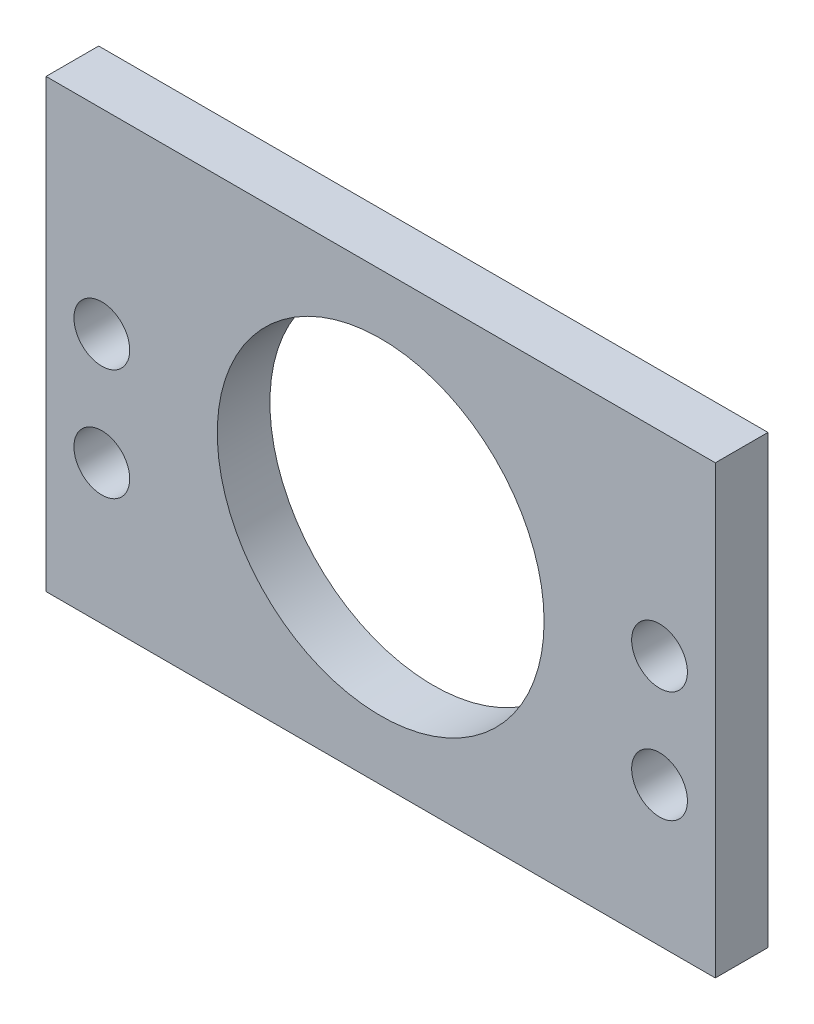
ISO-10303-21;
HEADER;
FILE_DESCRIPTION(('STEP AP214'),'2;1');
FILE_NAME('part.step','',(''),(''),'','','');
FILE_SCHEMA(('AUTOMOTIVE_DESIGN { 1 0 10303 214 1 1 1 1 }'));
ENDSEC;
DATA;
#1=APPLICATION_CONTEXT('core data for automotive mechanical design processes');
#2=APPLICATION_PROTOCOL_DEFINITION('international standard','automotive_design',2000,#1);
#3=PRODUCT_CONTEXT('',#1,'mechanical');
#4=PRODUCT('Part','Part','',(#3));
#5=PRODUCT_RELATED_PRODUCT_CATEGORY('part','',(#4));
#6=PRODUCT_DEFINITION_FORMATION('','',#4);
#7=PRODUCT_DEFINITION_CONTEXT('part definition',#1,'design');
#8=PRODUCT_DEFINITION('design','',#6,#7);
#9=PRODUCT_DEFINITION_SHAPE('','',#8);
#10=(LENGTH_UNIT() NAMED_UNIT(*) SI_UNIT(.MILLI.,.METRE.));
#11=(NAMED_UNIT(*) PLANE_ANGLE_UNIT() SI_UNIT($,.RADIAN.));
#12=(NAMED_UNIT(*) SI_UNIT($,.STERADIAN.) SOLID_ANGLE_UNIT());
#13=UNCERTAINTY_MEASURE_WITH_UNIT(LENGTH_MEASURE(1.E-05),#10,'distance_accuracy_value','');
#14=(GEOMETRIC_REPRESENTATION_CONTEXT(3) GLOBAL_UNCERTAINTY_ASSIGNED_CONTEXT((#13)) GLOBAL_UNIT_ASSIGNED_CONTEXT((#10,
#11,#12)) REPRESENTATION_CONTEXT('',''));
#15=CARTESIAN_POINT('',(0.,0.,0.));
#16=DIRECTION('',(0.,0.,1.));
#17=DIRECTION('',(1.,0.,0.));
#18=AXIS2_PLACEMENT_3D('',#15,#16,#17);
#19=CARTESIAN_POINT('',(0.,0.,5.9944));
#20=DIRECTION('',(0.,0.,-1.));
#21=DIRECTION('',(-1.,0.,0.));
#22=AXIS2_PLACEMENT_3D('',#19,#20,#21);
#23=PLANE('',#22);
#24=CARTESIAN_POINT('',(69.85,28.575,5.9944));
#25=DIRECTION('',(0.,0.,1.));
#26=DIRECTION('',(1.,0.,0.));
#27=AXIS2_PLACEMENT_3D('',#24,#25,#26);
#28=CIRCLE('',#27,3.175);
#29=CARTESIAN_POINT('',(73.025,28.575,5.9944));
#30=VERTEX_POINT('',#29);
#31=EDGE_CURVE('E126',#30,#30,#28,.T.);
#32=ORIENTED_EDGE('',*,*,#31,.F.);
#33=EDGE_LOOP('',(#32));
#34=FACE_BOUND('',#33,.T.);
#35=CARTESIAN_POINT('',(6.35,28.575,5.9944));
#36=DIRECTION('',(0.,0.,1.));
#37=DIRECTION('',(1.,0.,0.));
#38=AXIS2_PLACEMENT_3D('',#35,#36,#37);
#39=CIRCLE('',#38,3.175);
#40=CARTESIAN_POINT('',(9.525,28.575,5.9944));
#41=VERTEX_POINT('',#40);
#42=EDGE_CURVE('E114',#41,#41,#39,.T.);
#43=ORIENTED_EDGE('',*,*,#42,.F.);
#44=EDGE_LOOP('',(#43));
#45=FACE_BOUND('',#44,.T.);
#46=DIRECTION('',(0.,-1.,0.));
#47=VECTOR('',#46,1.);
#48=CARTESIAN_POINT('',(0.,0.,5.9944));
#49=LINE('',#48,#47);
#50=CARTESIAN_POINT('',(0.,50.8,5.9944));
#51=VERTEX_POINT('',#50);
#52=CARTESIAN_POINT('',(0.,0.,5.9944));
#53=VERTEX_POINT('',#52);
#54=EDGE_CURVE('E84',#51,#53,#49,.T.);
#55=ORIENTED_EDGE('',*,*,#54,.T.);
#56=DIRECTION('',(1.,0.,0.));
#57=VECTOR('',#56,1.);
#58=CARTESIAN_POINT('',(0.,0.,5.9944));
#59=LINE('',#58,#57);
#60=CARTESIAN_POINT('',(76.2,0.,5.9944));
#61=VERTEX_POINT('',#60);
#62=EDGE_CURVE('E79',#53,#61,#59,.T.);
#63=ORIENTED_EDGE('',*,*,#62,.T.);
#64=DIRECTION('',(0.,1.,0.));
#65=VECTOR('',#64,1.);
#66=CARTESIAN_POINT('',(76.2,0.,5.9944));
#67=LINE('',#66,#65);
#68=CARTESIAN_POINT('',(76.2,50.8,5.9944));
#69=VERTEX_POINT('',#68);
#70=EDGE_CURVE('E82',#61,#69,#67,.T.);
#71=ORIENTED_EDGE('',*,*,#70,.T.);
#72=DIRECTION('',(-1.,0.,0.));
#73=VECTOR('',#72,1.);
#74=CARTESIAN_POINT('',(0.,50.8,5.9944));
#75=LINE('',#74,#73);
#76=EDGE_CURVE('E49',#69,#51,#75,.T.);
#77=ORIENTED_EDGE('',*,*,#76,.T.);
#78=EDGE_LOOP('',(#55,#63,#71,#77));
#79=FACE_BOUND('',#78,.T.);
#80=CARTESIAN_POINT('',(38.1,25.4,5.9944));
#81=DIRECTION('',(0.,0.,1.));
#82=DIRECTION('',(1.,0.,0.));
#83=AXIS2_PLACEMENT_3D('',#80,#81,#82);
#84=CIRCLE('',#83,18.6055);
#85=CARTESIAN_POINT('',(56.7055,25.4,5.9944));
#86=VERTEX_POINT('',#85);
#87=EDGE_CURVE('E99',#86,#86,#84,.T.);
#88=ORIENTED_EDGE('',*,*,#87,.F.);
#89=EDGE_LOOP('',(#88));
#90=FACE_BOUND('',#89,.T.);
#91=CARTESIAN_POINT('',(6.35,15.875,5.9944));
#92=DIRECTION('',(0.,0.,1.));
#93=DIRECTION('',(1.,0.,0.));
#94=AXIS2_PLACEMENT_3D('',#91,#92,#93);
#95=CIRCLE('',#94,3.175);
#96=CARTESIAN_POINT('',(9.525,15.875,5.9944));
#97=VERTEX_POINT('',#96);
#98=EDGE_CURVE('E120',#97,#97,#95,.T.);
#99=ORIENTED_EDGE('',*,*,#98,.F.);
#100=EDGE_LOOP('',(#99));
#101=FACE_BOUND('',#100,.T.);
#102=CARTESIAN_POINT('',(69.85,15.875,5.9944));
#103=DIRECTION('',(0.,0.,1.));
#104=DIRECTION('',(1.,0.,0.));
#105=AXIS2_PLACEMENT_3D('',#102,#103,#104);
#106=CIRCLE('',#105,3.175);
#107=CARTESIAN_POINT('',(73.025,15.875,5.9944));
#108=VERTEX_POINT('',#107);
#109=EDGE_CURVE('E132',#108,#108,#106,.T.);
#110=ORIENTED_EDGE('',*,*,#109,.F.);
#111=EDGE_LOOP('',(#110));
#112=FACE_BOUND('',#111,.T.);
#113=ADVANCED_FACE('F32',(#34,#45,#79,#90,#101,#112),#23,.F.);
#114=CARTESIAN_POINT('',(0.,0.,0.));
#115=DIRECTION('',(0.,0.,-1.));
#116=DIRECTION('',(-1.,0.,0.));
#117=AXIS2_PLACEMENT_3D('',#114,#115,#116);
#118=PLANE('',#117);
#119=CARTESIAN_POINT('',(69.85,28.575,0.));
#120=DIRECTION('',(0.,0.,1.));
#121=DIRECTION('',(1.,0.,0.));
#122=AXIS2_PLACEMENT_3D('',#119,#120,#121);
#123=CIRCLE('',#122,3.175);
#124=CARTESIAN_POINT('',(73.025,28.575,0.));
#125=VERTEX_POINT('',#124);
#126=EDGE_CURVE('E129',#125,#125,#123,.T.);
#127=ORIENTED_EDGE('',*,*,#126,.T.);
#128=EDGE_LOOP('',(#127));
#129=FACE_BOUND('',#128,.T.);
#130=CARTESIAN_POINT('',(6.35,28.575,0.));
#131=DIRECTION('',(0.,0.,1.));
#132=DIRECTION('',(1.,0.,0.));
#133=AXIS2_PLACEMENT_3D('',#130,#131,#132);
#134=CIRCLE('',#133,3.175);
#135=CARTESIAN_POINT('',(9.525,28.575,0.));
#136=VERTEX_POINT('',#135);
#137=EDGE_CURVE('E117',#136,#136,#134,.T.);
#138=ORIENTED_EDGE('',*,*,#137,.T.);
#139=EDGE_LOOP('',(#138));
#140=FACE_BOUND('',#139,.T.);
#141=DIRECTION('',(0.,-1.,0.));
#142=VECTOR('',#141,1.);
#143=CARTESIAN_POINT('',(0.,0.,0.));
#144=LINE('',#143,#142);
#145=CARTESIAN_POINT('',(0.,50.8,0.));
#146=VERTEX_POINT('',#145);
#147=CARTESIAN_POINT('',(0.,0.,0.));
#148=VERTEX_POINT('',#147);
#149=EDGE_CURVE('E96',#146,#148,#144,.T.);
#150=ORIENTED_EDGE('',*,*,#149,.F.);
#151=DIRECTION('',(-1.,0.,0.));
#152=VECTOR('',#151,1.);
#153=CARTESIAN_POINT('',(0.,50.8,0.));
#154=LINE('',#153,#152);
#155=CARTESIAN_POINT('',(76.2,50.8,0.));
#156=VERTEX_POINT('',#155);
#157=EDGE_CURVE('E72',#156,#146,#154,.T.);
#158=ORIENTED_EDGE('',*,*,#157,.F.);
#159=DIRECTION('',(0.,1.,0.));
#160=VECTOR('',#159,1.);
#161=CARTESIAN_POINT('',(76.2,0.,0.));
#162=LINE('',#161,#160);
#163=CARTESIAN_POINT('',(76.2,0.,0.));
#164=VERTEX_POINT('',#163);
#165=EDGE_CURVE('E66',#164,#156,#162,.T.);
#166=ORIENTED_EDGE('',*,*,#165,.F.);
#167=DIRECTION('',(1.,0.,0.));
#168=VECTOR('',#167,1.);
#169=CARTESIAN_POINT('',(0.,0.,0.));
#170=LINE('',#169,#168);
#171=EDGE_CURVE('E88',#148,#164,#170,.T.);
#172=ORIENTED_EDGE('',*,*,#171,.F.);
#173=EDGE_LOOP('',(#150,#158,#166,#172));
#174=FACE_BOUND('',#173,.T.);
#175=CARTESIAN_POINT('',(38.1,25.4,0.));
#176=DIRECTION('',(0.,0.,1.));
#177=DIRECTION('',(1.,0.,0.));
#178=AXIS2_PLACEMENT_3D('',#175,#176,#177);
#179=CIRCLE('',#178,18.6055);
#180=CARTESIAN_POINT('',(56.7055,25.4,0.));
#181=VERTEX_POINT('',#180);
#182=EDGE_CURVE('E111',#181,#181,#179,.T.);
#183=ORIENTED_EDGE('',*,*,#182,.T.);
#184=EDGE_LOOP('',(#183));
#185=FACE_BOUND('',#184,.T.);
#186=CARTESIAN_POINT('',(6.35,15.875,0.));
#187=DIRECTION('',(0.,0.,1.));
#188=DIRECTION('',(1.,0.,0.));
#189=AXIS2_PLACEMENT_3D('',#186,#187,#188);
#190=CIRCLE('',#189,3.175);
#191=CARTESIAN_POINT('',(9.525,15.875,0.));
#192=VERTEX_POINT('',#191);
#193=EDGE_CURVE('E123',#192,#192,#190,.T.);
#194=ORIENTED_EDGE('',*,*,#193,.T.);
#195=EDGE_LOOP('',(#194));
#196=FACE_BOUND('',#195,.T.);
#197=CARTESIAN_POINT('',(69.85,15.875,0.));
#198=DIRECTION('',(0.,0.,1.));
#199=DIRECTION('',(1.,0.,0.));
#200=AXIS2_PLACEMENT_3D('',#197,#198,#199);
#201=CIRCLE('',#200,3.175);
#202=CARTESIAN_POINT('',(73.025,15.875,0.));
#203=VERTEX_POINT('',#202);
#204=EDGE_CURVE('E135',#203,#203,#201,.T.);
#205=ORIENTED_EDGE('',*,*,#204,.T.);
#206=EDGE_LOOP('',(#205));
#207=FACE_BOUND('',#206,.T.);
#208=ADVANCED_FACE('F107',(#129,#140,#174,#185,#196,#207),#118,.T.);
#209=CARTESIAN_POINT('',(0.,0.,5.9944));
#210=DIRECTION('',(1.,0.,0.));
#211=DIRECTION('',(0.,0.,-1.));
#212=AXIS2_PLACEMENT_3D('',#209,#210,#211);
#213=PLANE('',#212);
#214=ORIENTED_EDGE('',*,*,#149,.T.);
#215=DIRECTION('',(0.,0.,-1.));
#216=VECTOR('',#215,1.);
#217=CARTESIAN_POINT('',(0.,0.,5.9944));
#218=LINE('',#217,#216);
#219=EDGE_CURVE('E11',#53,#148,#218,.T.);
#220=ORIENTED_EDGE('',*,*,#219,.F.);
#221=ORIENTED_EDGE('',*,*,#54,.F.);
#222=DIRECTION('',(0.,0.,-1.));
#223=VECTOR('',#222,1.);
#224=CARTESIAN_POINT('',(0.,50.8,5.9944));
#225=LINE('',#224,#223);
#226=EDGE_CURVE('E92',#51,#146,#225,.T.);
#227=ORIENTED_EDGE('',*,*,#226,.T.);
#228=EDGE_LOOP('',(#214,#220,#221,#227));
#229=FACE_BOUND('',#228,.T.);
#230=ADVANCED_FACE('F34',(#229),#213,.F.);
#231=CARTESIAN_POINT('',(0.,0.,5.9944));
#232=DIRECTION('',(0.,1.,0.));
#233=DIRECTION('',(0.,0.,1.));
#234=AXIS2_PLACEMENT_3D('',#231,#232,#233);
#235=PLANE('',#234);
#236=ORIENTED_EDGE('',*,*,#171,.T.);
#237=DIRECTION('',(0.,0.,-1.));
#238=VECTOR('',#237,1.);
#239=CARTESIAN_POINT('',(76.2,0.,5.9944));
#240=LINE('',#239,#238);
#241=EDGE_CURVE('E41',#61,#164,#240,.T.);
#242=ORIENTED_EDGE('',*,*,#241,.F.);
#243=ORIENTED_EDGE('',*,*,#62,.F.);
#244=ORIENTED_EDGE('',*,*,#219,.T.);
#245=EDGE_LOOP('',(#236,#242,#243,#244));
#246=FACE_BOUND('',#245,.T.);
#247=ADVANCED_FACE('F87',(#246),#235,.F.);
#248=CARTESIAN_POINT('',(76.2,0.,5.9944));
#249=DIRECTION('',(-1.,0.,0.));
#250=DIRECTION('',(0.,0.,1.));
#251=AXIS2_PLACEMENT_3D('',#248,#249,#250);
#252=PLANE('',#251);
#253=ORIENTED_EDGE('',*,*,#165,.T.);
#254=DIRECTION('',(0.,0.,-1.));
#255=VECTOR('',#254,1.);
#256=CARTESIAN_POINT('',(76.2,50.8,5.9944));
#257=LINE('',#256,#255);
#258=EDGE_CURVE('E89',#69,#156,#257,.T.);
#259=ORIENTED_EDGE('',*,*,#258,.F.);
#260=ORIENTED_EDGE('',*,*,#70,.F.);
#261=ORIENTED_EDGE('',*,*,#241,.T.);
#262=EDGE_LOOP('',(#253,#259,#260,#261));
#263=FACE_BOUND('',#262,.T.);
#264=ADVANCED_FACE('F90',(#263),#252,.F.);
#265=CARTESIAN_POINT('',(0.,50.8,5.9944));
#266=DIRECTION('',(0.,-1.,0.));
#267=DIRECTION('',(0.,0.,-1.));
#268=AXIS2_PLACEMENT_3D('',#265,#266,#267);
#269=PLANE('',#268);
#270=ORIENTED_EDGE('',*,*,#157,.T.);
#271=ORIENTED_EDGE('',*,*,#226,.F.);
#272=ORIENTED_EDGE('',*,*,#76,.F.);
#273=ORIENTED_EDGE('',*,*,#258,.T.);
#274=EDGE_LOOP('',(#270,#271,#272,#273));
#275=FACE_BOUND('',#274,.T.);
#276=ADVANCED_FACE('F104',(#275),#269,.F.);
#277=CARTESIAN_POINT('',(38.1,25.4,5.9944));
#278=DIRECTION('',(0.,0.,-1.));
#279=DIRECTION('',(-1.,0.,0.));
#280=AXIS2_PLACEMENT_3D('',#277,#278,#279);
#281=CYLINDRICAL_SURFACE('',#280,18.6055);
#282=ORIENTED_EDGE('',*,*,#87,.T.);
#283=EDGE_LOOP('',(#282));
#284=FACE_BOUND('',#283,.T.);
#285=ORIENTED_EDGE('',*,*,#182,.F.);
#286=EDGE_LOOP('',(#285));
#287=FACE_BOUND('',#286,.T.);
#288=ADVANCED_FACE('F155',(#284,#287),#281,.F.);
#289=CARTESIAN_POINT('',(6.35,28.575,5.9944));
#290=DIRECTION('',(0.,0.,-1.));
#291=DIRECTION('',(-1.,0.,0.));
#292=AXIS2_PLACEMENT_3D('',#289,#290,#291);
#293=CYLINDRICAL_SURFACE('',#292,3.175);
#294=ORIENTED_EDGE('',*,*,#42,.T.);
#295=EDGE_LOOP('',(#294));
#296=FACE_BOUND('',#295,.T.);
#297=ORIENTED_EDGE('',*,*,#137,.F.);
#298=EDGE_LOOP('',(#297));
#299=FACE_BOUND('',#298,.T.);
#300=ADVANCED_FACE('F201',(#296,#299),#293,.F.);
#301=CARTESIAN_POINT('',(6.35,15.875,5.9944));
#302=DIRECTION('',(0.,0.,-1.));
#303=DIRECTION('',(-1.,0.,0.));
#304=AXIS2_PLACEMENT_3D('',#301,#302,#303);
#305=CYLINDRICAL_SURFACE('',#304,3.175);
#306=ORIENTED_EDGE('',*,*,#98,.T.);
#307=EDGE_LOOP('',(#306));
#308=FACE_BOUND('',#307,.T.);
#309=ORIENTED_EDGE('',*,*,#193,.F.);
#310=EDGE_LOOP('',(#309));
#311=FACE_BOUND('',#310,.T.);
#312=ADVANCED_FACE('F209',(#308,#311),#305,.F.);
#313=CARTESIAN_POINT('',(69.85,28.575,5.9944));
#314=DIRECTION('',(0.,0.,-1.));
#315=DIRECTION('',(-1.,0.,0.));
#316=AXIS2_PLACEMENT_3D('',#313,#314,#315);
#317=CYLINDRICAL_SURFACE('',#316,3.175);
#318=ORIENTED_EDGE('',*,*,#31,.T.);
#319=EDGE_LOOP('',(#318));
#320=FACE_BOUND('',#319,.T.);
#321=ORIENTED_EDGE('',*,*,#126,.F.);
#322=EDGE_LOOP('',(#321));
#323=FACE_BOUND('',#322,.T.);
#324=ADVANCED_FACE('F217',(#320,#323),#317,.F.);
#325=CARTESIAN_POINT('',(69.85,15.875,5.9944));
#326=DIRECTION('',(0.,0.,-1.));
#327=DIRECTION('',(-1.,0.,0.));
#328=AXIS2_PLACEMENT_3D('',#325,#326,#327);
#329=CYLINDRICAL_SURFACE('',#328,3.175);
#330=ORIENTED_EDGE('',*,*,#109,.T.);
#331=EDGE_LOOP('',(#330));
#332=FACE_BOUND('',#331,.T.);
#333=ORIENTED_EDGE('',*,*,#204,.F.);
#334=EDGE_LOOP('',(#333));
#335=FACE_BOUND('',#334,.T.);
#336=ADVANCED_FACE('F141',(#332,#335),#329,.F.);
#337=CLOSED_SHELL('',(#113,#208,#230,#247,#264,#276,#288,#300,#312,#324,#336));
#338=MANIFOLD_SOLID_BREP('B2',#337);
#339=ADVANCED_BREP_SHAPE_REPRESENTATION('',(#18,#338),#14);
#340=SHAPE_DEFINITION_REPRESENTATION(#9,#339);
ENDSEC;
END-ISO-10303-21;
